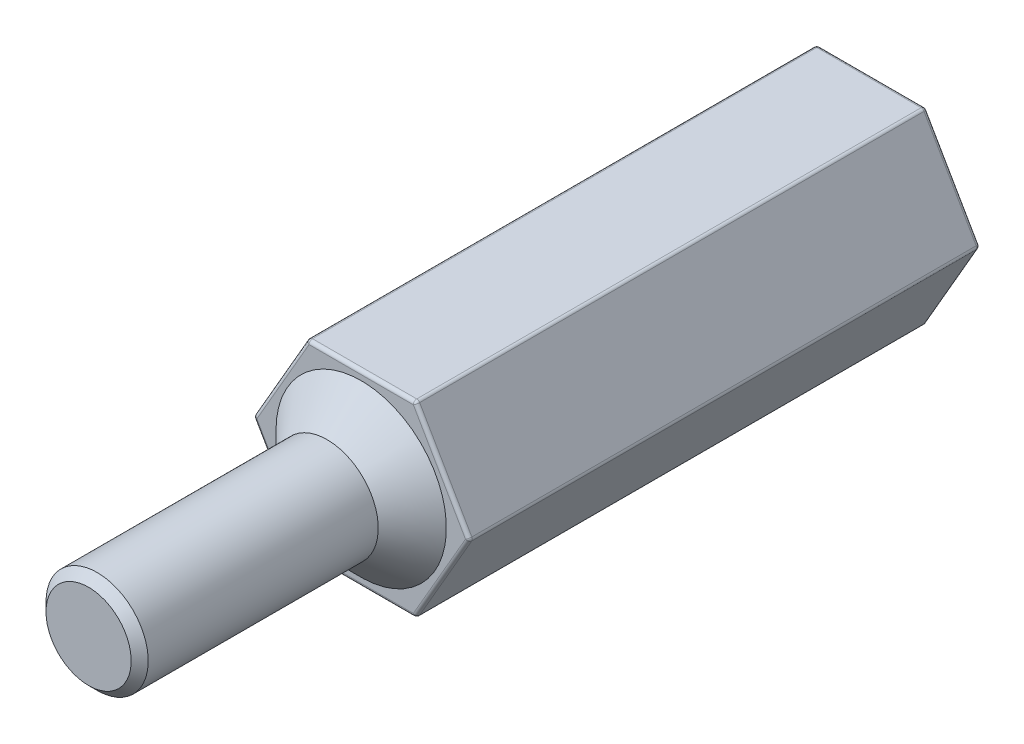
ISO-10303-21;
HEADER;
FILE_DESCRIPTION(('STEP AP214'),'2;1');
FILE_NAME('part.step','',(''),(''),'','','');
FILE_SCHEMA(('AUTOMOTIVE_DESIGN { 1 0 10303 214 1 1 1 1 }'));
ENDSEC;
DATA;
#1=APPLICATION_CONTEXT('core data for automotive mechanical design processes');
#2=APPLICATION_PROTOCOL_DEFINITION('international standard','automotive_design',2000,#1);
#3=PRODUCT_CONTEXT('',#1,'mechanical');
#4=PRODUCT('Part','Part','',(#3));
#5=PRODUCT_RELATED_PRODUCT_CATEGORY('part','',(#4));
#6=PRODUCT_DEFINITION_FORMATION('','',#4);
#7=PRODUCT_DEFINITION_CONTEXT('part definition',#1,'design');
#8=PRODUCT_DEFINITION('design','',#6,#7);
#9=PRODUCT_DEFINITION_SHAPE('','',#8);
#10=(LENGTH_UNIT() NAMED_UNIT(*) SI_UNIT(.MILLI.,.METRE.));
#11=(NAMED_UNIT(*) PLANE_ANGLE_UNIT() SI_UNIT($,.RADIAN.));
#12=(NAMED_UNIT(*) SI_UNIT($,.STERADIAN.) SOLID_ANGLE_UNIT());
#13=UNCERTAINTY_MEASURE_WITH_UNIT(LENGTH_MEASURE(1.E-05),#10,'distance_accuracy_value','');
#14=(GEOMETRIC_REPRESENTATION_CONTEXT(3) GLOBAL_UNCERTAINTY_ASSIGNED_CONTEXT((#13)) GLOBAL_UNIT_ASSIGNED_CONTEXT((#10,
#11,#12)) REPRESENTATION_CONTEXT('',''));
#15=CARTESIAN_POINT('',(0.,0.,0.));
#16=DIRECTION('',(0.,0.,1.));
#17=DIRECTION('',(1.,0.,0.));
#18=AXIS2_PLACEMENT_3D('',#15,#16,#17);
#19=CARTESIAN_POINT('',(0.,0.,8.));
#20=DIRECTION('',(0.,0.,1.));
#21=DIRECTION('',(1.,0.,0.));
#22=AXIS2_PLACEMENT_3D('',#19,#20,#21);
#23=PLANE('',#22);
#24=CARTESIAN_POINT('',(0.,0.,7.99999999998136));
#25=DIRECTION('',(0.,0.,-1.));
#26=DIRECTION('',(-1.,0.,0.));
#27=AXIS2_PLACEMENT_3D('',#24,#25,#26);
#28=CIRCLE('',#27,1.25000000002728);
#29=CARTESIAN_POINT('',(-1.25000000002728,0.,7.99999999998136));
#30=VERTEX_POINT('',#29);
#31=EDGE_CURVE('E20',#30,#30,#28,.T.);
#32=ORIENTED_EDGE('',*,*,#31,.F.);
#33=EDGE_LOOP('',(#32));
#34=FACE_BOUND('',#33,.T.);
#35=ADVANCED_FACE('F17',(#34),#23,.T.);
#36=CARTESIAN_POINT('',(0.,0.,7.74999999998727));
#37=DIRECTION('',(0.,0.,-1.));
#38=DIRECTION('',(-1.,0.,0.));
#39=AXIS2_PLACEMENT_3D('',#36,#37,#38);
#40=CONICAL_SURFACE('',#39,1.50000000002137,0.785398163397448);
#41=CARTESIAN_POINT('',(0.,0.,7.74999999999999));
#42=DIRECTION('',(0.,0.,-1.));
#43=DIRECTION('',(-1.,0.,0.));
#44=AXIS2_PLACEMENT_3D('',#41,#42,#43);
#45=CIRCLE('',#44,1.5);
#46=CARTESIAN_POINT('',(-1.5,0.,7.74999999999999));
#47=VERTEX_POINT('',#46);
#48=EDGE_CURVE('E205',#47,#47,#45,.T.);
#49=ORIENTED_EDGE('',*,*,#48,.F.);
#50=EDGE_LOOP('',(#49));
#51=FACE_BOUND('',#50,.T.);
#52=ORIENTED_EDGE('',*,*,#31,.T.);
#53=EDGE_LOOP('',(#52));
#54=FACE_BOUND('',#53,.T.);
#55=ADVANCED_FACE('F921',(#51,#54),#40,.T.);
#56=CARTESIAN_POINT('',(0.,0.,8.));
#57=DIRECTION('',(0.,0.,-1.));
#58=DIRECTION('',(-1.,0.,0.));
#59=AXIS2_PLACEMENT_3D('',#56,#57,#58);
#60=CYLINDRICAL_SURFACE('',#59,1.5);
#61=CARTESIAN_POINT('',(0.,0.,0.99999999991951));
#62=DIRECTION('',(0.,0.,-1.));
#63=DIRECTION('',(-1.,0.,0.));
#64=AXIS2_PLACEMENT_3D('',#61,#62,#63);
#65=CIRCLE('',#64,1.50000000002137);
#66=CARTESIAN_POINT('',(-1.50000000002137,0.,0.99999999991951));
#67=VERTEX_POINT('',#66);
#68=EDGE_CURVE('E201',#67,#67,#65,.T.);
#69=ORIENTED_EDGE('',*,*,#68,.F.);
#70=EDGE_LOOP('',(#69));
#71=FACE_BOUND('',#70,.T.);
#72=ORIENTED_EDGE('',*,*,#48,.T.);
#73=EDGE_LOOP('',(#72));
#74=FACE_BOUND('',#73,.T.);
#75=ADVANCED_FACE('F915',(#71,#74),#60,.T.);
#76=CARTESIAN_POINT('',(0.,0.,-5.6843418860808E-11));
#77=DIRECTION('',(0.,0.,-1.));
#78=DIRECTION('',(-1.,0.,0.));
#79=AXIS2_PLACEMENT_3D('',#76,#77,#78);
#80=CONICAL_SURFACE('',#79,2.49999999999773,0.785398163397448);
#81=CARTESIAN_POINT('',(0.,0.,-5.6843418860808E-11));
#82=DIRECTION('',(0.,0.,-1.));
#83=DIRECTION('',(-1.,0.,0.));
#84=AXIS2_PLACEMENT_3D('',#81,#82,#83);
#85=CIRCLE('',#84,2.49999999999773);
#86=CARTESIAN_POINT('',(-2.49999999999773,0.,-5.6843418860808E-11));
#87=VERTEX_POINT('',#86);
#88=EDGE_CURVE('E199',#87,#87,#85,.F.);
#89=ORIENTED_EDGE('',*,*,#88,.T.);
#90=EDGE_LOOP('',(#89));
#91=FACE_BOUND('',#90,.T.);
#92=ORIENTED_EDGE('',*,*,#68,.T.);
#93=EDGE_LOOP('',(#92));
#94=FACE_BOUND('',#93,.T.);
#95=ADVANCED_FACE('F372',(#91,#94),#80,.T.);
#96=CARTESIAN_POINT('',(-1.52997821335251,2.65,-0.1));
#97=DIRECTION('',(1.,0.,0.));
#98=DIRECTION('',(0.,0.,-1.));
#99=AXIS2_PLACEMENT_3D('',#96,#97,#98);
#100=SPHERICAL_SURFACE('',#99,0.1);
#101=CARTESIAN_POINT('',(-1.52997821335251,2.65,-0.0999999999999994));
#102=DIRECTION('',(1.,0.,0.));
#103=DIRECTION('',(0.,0.,-1.));
#104=AXIS2_PLACEMENT_3D('',#101,#102,#103);
#105=CIRCLE('',#104,0.1);
#106=CARTESIAN_POINT('',(-1.52997821335251,2.75,-0.0999999999999994));
#107=VERTEX_POINT('',#106);
#108=CARTESIAN_POINT('',(-1.52997821335251,2.65,0.));
#109=VERTEX_POINT('',#108);
#110=EDGE_CURVE('E195',#107,#109,#105,.T.);
#111=ORIENTED_EDGE('',*,*,#110,.F.);
#112=CARTESIAN_POINT('',(-1.52997821335251,2.65,-0.0999999999999994));
#113=DIRECTION('',(0.,0.,1.));
#114=DIRECTION('',(1.,0.,0.));
#115=AXIS2_PLACEMENT_3D('',#112,#113,#114);
#116=CIRCLE('',#115,0.1);
#117=CARTESIAN_POINT('',(-1.61658075373095,2.7,-0.0999999999999994));
#118=VERTEX_POINT('',#117);
#119=EDGE_CURVE('E309',#118,#107,#116,.F.);
#120=ORIENTED_EDGE('',*,*,#119,.F.);
#121=CARTESIAN_POINT('',(-1.52997821335251,2.65,-0.0999999999999994));
#122=DIRECTION('',(0.5,0.866025403784439,0.));
#123=DIRECTION('',(-0.866025403784439,0.5,0.));
#124=AXIS2_PLACEMENT_3D('',#121,#122,#123);
#125=CIRCLE('',#124,0.0999999999999999);
#126=EDGE_CURVE('E193',#109,#118,#125,.F.);
#127=ORIENTED_EDGE('',*,*,#126,.F.);
#128=EDGE_LOOP('',(#111,#120,#127));
#129=FACE_BOUND('',#128,.T.);
#130=ADVANCED_FACE('F368',(#129),#100,.T.);
#131=CARTESIAN_POINT('',(1.52997821335251,2.65,-0.1));
#132=DIRECTION('',(1.,0.,0.));
#133=DIRECTION('',(0.,0.,-1.));
#134=AXIS2_PLACEMENT_3D('',#131,#132,#133);
#135=SPHERICAL_SURFACE('',#134,0.1);
#136=CARTESIAN_POINT('',(1.52997821335251,2.65,-0.0999999999999994));
#137=DIRECTION('',(0.5,-0.866025403784439,0.));
#138=DIRECTION('',(0.866025403784439,0.5,0.));
#139=AXIS2_PLACEMENT_3D('',#136,#137,#138);
#140=CIRCLE('',#139,0.1);
#141=CARTESIAN_POINT('',(1.61658075373095,2.7,-0.0999999999999994));
#142=VERTEX_POINT('',#141);
#143=CARTESIAN_POINT('',(1.52997821335251,2.65,0.));
#144=VERTEX_POINT('',#143);
#145=EDGE_CURVE('E186',#142,#144,#140,.T.);
#146=ORIENTED_EDGE('',*,*,#145,.F.);
#147=CARTESIAN_POINT('',(1.52997821335251,2.65,-0.0999999999999994));
#148=DIRECTION('',(0.,0.,1.));
#149=DIRECTION('',(1.,0.,0.));
#150=AXIS2_PLACEMENT_3D('',#147,#148,#149);
#151=CIRCLE('',#150,0.1);
#152=CARTESIAN_POINT('',(1.52997821335251,2.75,-0.0999999999999994));
#153=VERTEX_POINT('',#152);
#154=EDGE_CURVE('E185',#153,#142,#151,.F.);
#155=ORIENTED_EDGE('',*,*,#154,.F.);
#156=CARTESIAN_POINT('',(1.52997821335251,2.65,-0.0999999999999994));
#157=DIRECTION('',(1.,0.,0.));
#158=DIRECTION('',(0.,0.,-1.));
#159=AXIS2_PLACEMENT_3D('',#156,#157,#158);
#160=CIRCLE('',#159,0.1);
#161=EDGE_CURVE('E96',#144,#153,#160,.F.);
#162=ORIENTED_EDGE('',*,*,#161,.F.);
#163=EDGE_LOOP('',(#146,#155,#162));
#164=FACE_BOUND('',#163,.T.);
#165=ADVANCED_FACE('F365',(#164),#135,.T.);
#166=CARTESIAN_POINT('',(3.05995642670502,0.,-0.1));
#167=DIRECTION('',(1.,0.,0.));
#168=DIRECTION('',(0.,0.,-1.));
#169=AXIS2_PLACEMENT_3D('',#166,#167,#168);
#170=SPHERICAL_SURFACE('',#169,0.1);
#171=CARTESIAN_POINT('',(3.05995642670502,0.,-0.0999999999999994));
#172=DIRECTION('',(0.,0.,1.));
#173=DIRECTION('',(1.,0.,0.));
#174=AXIS2_PLACEMENT_3D('',#171,#172,#173);
#175=CIRCLE('',#174,0.0999999999999998);
#176=CARTESIAN_POINT('',(3.15995642670502,0.,-0.0999999999999995));
#177=VERTEX_POINT('',#176);
#178=CARTESIAN_POINT('',(3.14655896708346,-0.0500000000000013,-0.0999999999999994));
#179=VERTEX_POINT('',#178);
#180=EDGE_CURVE('E285',#177,#179,#175,.F.);
#181=ORIENTED_EDGE('',*,*,#180,.F.);
#182=CARTESIAN_POINT('',(3.05995642670502,0.,-0.0999999999999994));
#183=DIRECTION('',(0.,0.,1.));
#184=DIRECTION('',(1.,0.,0.));
#185=AXIS2_PLACEMENT_3D('',#182,#183,#184);
#186=CIRCLE('',#185,0.0999999999999998);
#187=CARTESIAN_POINT('',(3.14655896708346,0.0499999999999986,-0.0999999999999994));
#188=VERTEX_POINT('',#187);
#189=EDGE_CURVE('E192',#188,#177,#186,.F.);
#190=ORIENTED_EDGE('',*,*,#189,.F.);
#191=CARTESIAN_POINT('',(3.05995642670502,0.,-0.0999999999999994));
#192=DIRECTION('',(0.5,-0.866025403784439,0.));
#193=DIRECTION('',(0.866025403784439,0.5,0.));
#194=AXIS2_PLACEMENT_3D('',#191,#192,#193);
#195=CIRCLE('',#194,0.1);
#196=CARTESIAN_POINT('',(3.05995642670502,0.,0.));
#197=VERTEX_POINT('',#196);
#198=EDGE_CURVE('E190',#197,#188,#195,.F.);
#199=ORIENTED_EDGE('',*,*,#198,.F.);
#200=CARTESIAN_POINT('',(3.05995642670502,0.,-0.0999999999999994));
#201=DIRECTION('',(-0.5,-0.866025403784439,0.));
#202=DIRECTION('',(0.866025403784439,-0.5,0.));
#203=AXIS2_PLACEMENT_3D('',#200,#201,#202);
#204=CIRCLE('',#203,0.0999999999999999);
#205=EDGE_CURVE('E179',#179,#197,#204,.T.);
#206=ORIENTED_EDGE('',*,*,#205,.F.);
#207=EDGE_LOOP('',(#181,#190,#199,#206));
#208=FACE_BOUND('',#207,.T.);
#209=ADVANCED_FACE('F353',(#208),#170,.T.);
#210=CARTESIAN_POINT('',(1.52997821335251,-2.65,-0.1));
#211=DIRECTION('',(1.,0.,0.));
#212=DIRECTION('',(0.,0.,-1.));
#213=AXIS2_PLACEMENT_3D('',#210,#211,#212);
#214=SPHERICAL_SURFACE('',#213,0.1);
#215=CARTESIAN_POINT('',(1.52997821335251,-2.65,-0.0999999999999994));
#216=DIRECTION('',(-1.,0.,0.));
#217=DIRECTION('',(0.,-1.,0.));
#218=AXIS2_PLACEMENT_3D('',#215,#216,#217);
#219=CIRCLE('',#218,0.0999999999999998);
#220=CARTESIAN_POINT('',(1.52997821335251,-2.75,-0.0999999999999994));
#221=VERTEX_POINT('',#220);
#222=CARTESIAN_POINT('',(1.52997821335251,-2.65,0.));
#223=VERTEX_POINT('',#222);
#224=EDGE_CURVE('E284',#221,#223,#219,.T.);
#225=ORIENTED_EDGE('',*,*,#224,.F.);
#226=CARTESIAN_POINT('',(1.52997821335251,-2.65,-0.0999999999999994));
#227=DIRECTION('',(0.,0.,1.));
#228=DIRECTION('',(1.,0.,0.));
#229=AXIS2_PLACEMENT_3D('',#226,#227,#228);
#230=CIRCLE('',#229,0.1);
#231=CARTESIAN_POINT('',(1.61658075373095,-2.7,-0.0999999999999994));
#232=VERTEX_POINT('',#231);
#233=EDGE_CURVE('E178',#232,#221,#230,.F.);
#234=ORIENTED_EDGE('',*,*,#233,.F.);
#235=CARTESIAN_POINT('',(1.52997821335251,-2.65,-0.0999999999999994));
#236=DIRECTION('',(-0.5,-0.866025403784439,0.));
#237=DIRECTION('',(0.866025403784439,-0.5,0.));
#238=AXIS2_PLACEMENT_3D('',#235,#236,#237);
#239=CIRCLE('',#238,0.0999999999999999);
#240=EDGE_CURVE('E183',#223,#232,#239,.F.);
#241=ORIENTED_EDGE('',*,*,#240,.F.);
#242=EDGE_LOOP('',(#225,#234,#241));
#243=FACE_BOUND('',#242,.T.);
#244=ADVANCED_FACE('F348',(#243),#214,.T.);
#245=CARTESIAN_POINT('',(-3.17542648054294,0.,0.));
#246=DIRECTION('',(0.,0.,-1.));
#247=DIRECTION('',(-1.,0.,0.));
#248=AXIS2_PLACEMENT_3D('',#245,#246,#247);
#249=PLANE('',#248);
#250=ORIENTED_EDGE('',*,*,#88,.F.);
#251=EDGE_LOOP('',(#250));
#252=FACE_BOUND('',#251,.T.);
#253=DIRECTION('',(1.,0.,0.));
#254=VECTOR('',#253,1.);
#255=CARTESIAN_POINT('',(-1.58771324027147,2.65,0.));
#256=LINE('',#255,#254);
#257=EDGE_CURVE('E323',#109,#144,#256,.T.);
#258=ORIENTED_EDGE('',*,*,#257,.F.);
#259=DIRECTION('',(0.5,0.866025403784439,0.));
#260=VECTOR('',#259,1.);
#261=CARTESIAN_POINT('',(-3.0888239401645,-0.0499999999999996,0.));
#262=LINE('',#261,#260);
#263=CARTESIAN_POINT('',(-3.05995642670502,0.,0.));
#264=VERTEX_POINT('',#263);
#265=EDGE_CURVE('E196',#264,#109,#262,.T.);
#266=ORIENTED_EDGE('',*,*,#265,.F.);
#267=DIRECTION('',(-0.5,0.866025403784439,0.));
#268=VECTOR('',#267,1.);
#269=CARTESIAN_POINT('',(-1.50111069989303,-2.7,0.));
#270=LINE('',#269,#268);
#271=CARTESIAN_POINT('',(-1.52997821335251,-2.65,0.));
#272=VERTEX_POINT('',#271);
#273=EDGE_CURVE('E174',#272,#264,#270,.T.);
#274=ORIENTED_EDGE('',*,*,#273,.F.);
#275=DIRECTION('',(-1.,0.,0.));
#276=VECTOR('',#275,1.);
#277=CARTESIAN_POINT('',(1.58771324027147,-2.65,0.));
#278=LINE('',#277,#276);
#279=EDGE_CURVE('E278',#223,#272,#278,.T.);
#280=ORIENTED_EDGE('',*,*,#279,.F.);
#281=DIRECTION('',(-0.5,-0.866025403784439,0.));
#282=VECTOR('',#281,1.);
#283=CARTESIAN_POINT('',(3.0888239401645,0.0499999999999992,0.));
#284=LINE('',#283,#282);
#285=EDGE_CURVE('E182',#197,#223,#284,.T.);
#286=ORIENTED_EDGE('',*,*,#285,.F.);
#287=DIRECTION('',(0.5,-0.866025403784439,0.));
#288=VECTOR('',#287,1.);
#289=CARTESIAN_POINT('',(1.50111069989303,2.7,0.));
#290=LINE('',#289,#288);
#291=EDGE_CURVE('E189',#144,#197,#290,.T.);
#292=ORIENTED_EDGE('',*,*,#291,.F.);
#293=EDGE_LOOP('',(#258,#266,#274,#280,#286,#292));
#294=FACE_BOUND('',#293,.T.);
#295=ADVANCED_FACE('F344',(#252,#294),#249,.F.);
#296=CARTESIAN_POINT('',(-1.52997821335251,-2.65,-0.1));
#297=DIRECTION('',(1.,0.,0.));
#298=DIRECTION('',(0.,0.,-1.));
#299=AXIS2_PLACEMENT_3D('',#296,#297,#298);
#300=SPHERICAL_SURFACE('',#299,0.1);
#301=CARTESIAN_POINT('',(-1.52997821335251,-2.65,-0.0999999999999994));
#302=DIRECTION('',(-1.,0.,0.));
#303=DIRECTION('',(0.,-1.,0.));
#304=AXIS2_PLACEMENT_3D('',#301,#302,#303);
#305=CIRCLE('',#304,0.0999999999999998);
#306=CARTESIAN_POINT('',(-1.52997821335251,-2.75,-0.0999999999999994));
#307=VERTEX_POINT('',#306);
#308=EDGE_CURVE('E281',#272,#307,#305,.F.);
#309=ORIENTED_EDGE('',*,*,#308,.F.);
#310=CARTESIAN_POINT('',(-1.52997821335251,-2.65,-0.0999999999999994));
#311=DIRECTION('',(-0.5,0.866025403784439,0.));
#312=DIRECTION('',(-0.866025403784439,-0.5,0.));
#313=AXIS2_PLACEMENT_3D('',#310,#311,#312);
#314=CIRCLE('',#313,0.1);
#315=CARTESIAN_POINT('',(-1.61658075373095,-2.7,-0.0999999999999994));
#316=VERTEX_POINT('',#315);
#317=EDGE_CURVE('E175',#316,#272,#314,.T.);
#318=ORIENTED_EDGE('',*,*,#317,.F.);
#319=CARTESIAN_POINT('',(-1.52997821335251,-2.65,-0.0999999999999994));
#320=DIRECTION('',(0.,0.,1.));
#321=DIRECTION('',(1.,0.,0.));
#322=AXIS2_PLACEMENT_3D('',#319,#320,#321);
#323=CIRCLE('',#322,0.1);
#324=EDGE_CURVE('E173',#307,#316,#323,.F.);
#325=ORIENTED_EDGE('',*,*,#324,.F.);
#326=EDGE_LOOP('',(#309,#318,#325));
#327=FACE_BOUND('',#326,.T.);
#328=ADVANCED_FACE('F339',(#327),#300,.T.);
#329=CARTESIAN_POINT('',(-3.05995642670502,0.,-0.1));
#330=DIRECTION('',(1.,0.,0.));
#331=DIRECTION('',(0.,0.,-1.));
#332=AXIS2_PLACEMENT_3D('',#329,#330,#331);
#333=SPHERICAL_SURFACE('',#332,0.1);
#334=CARTESIAN_POINT('',(-3.05995642670502,0.,-0.0999999999999994));
#335=DIRECTION('',(-0.5,0.866025403784439,0.));
#336=DIRECTION('',(-0.866025403784439,-0.5,0.));
#337=AXIS2_PLACEMENT_3D('',#334,#335,#336);
#338=CIRCLE('',#337,0.1);
#339=CARTESIAN_POINT('',(-3.14655896708346,-0.049999999999999,-0.0999999999999994));
#340=VERTEX_POINT('',#339);
#341=EDGE_CURVE('E171',#264,#340,#338,.F.);
#342=ORIENTED_EDGE('',*,*,#341,.F.);
#343=CARTESIAN_POINT('',(-3.05995642670502,0.,-0.0999999999999994));
#344=DIRECTION('',(0.5,0.866025403784439,0.));
#345=DIRECTION('',(-0.866025403784439,0.5,0.));
#346=AXIS2_PLACEMENT_3D('',#343,#344,#345);
#347=CIRCLE('',#346,0.0999999999999999);
#348=CARTESIAN_POINT('',(-3.14655896708346,0.0500000000000008,-0.0999999999999994));
#349=VERTEX_POINT('',#348);
#350=EDGE_CURVE('E197',#349,#264,#347,.T.);
#351=ORIENTED_EDGE('',*,*,#350,.F.);
#352=CARTESIAN_POINT('',(-3.05995642670502,0.,-0.0999999999999994));
#353=DIRECTION('',(0.,0.,1.));
#354=DIRECTION('',(1.,0.,0.));
#355=AXIS2_PLACEMENT_3D('',#352,#353,#354);
#356=CIRCLE('',#355,0.0999999999999998);
#357=CARTESIAN_POINT('',(-3.15995642670502,0.,-0.0999999999999994));
#358=VERTEX_POINT('',#357);
#359=EDGE_CURVE('E89',#358,#349,#356,.F.);
#360=ORIENTED_EDGE('',*,*,#359,.F.);
#361=CARTESIAN_POINT('',(-3.05995642670502,0.,-0.0999999999999994));
#362=DIRECTION('',(0.,0.,1.));
#363=DIRECTION('',(1.,0.,0.));
#364=AXIS2_PLACEMENT_3D('',#361,#362,#363);
#365=CIRCLE('',#364,0.0999999999999998);
#366=EDGE_CURVE('E35',#340,#358,#365,.F.);
#367=ORIENTED_EDGE('',*,*,#366,.F.);
#368=EDGE_LOOP('',(#342,#351,#360,#367));
#369=FACE_BOUND('',#368,.T.);
#370=ADVANCED_FACE('F334',(#369),#333,.T.);
#371=CARTESIAN_POINT('',(-3.0888239401645,-0.0499999999999996,-0.0999999999999994));
#372=DIRECTION('',(0.5,0.866025403784439,0.));
#373=DIRECTION('',(-0.866025403784439,0.5,0.));
#374=AXIS2_PLACEMENT_3D('',#371,#372,#373);
#375=CYLINDRICAL_SURFACE('',#374,0.0999999999999999);
#376=ORIENTED_EDGE('',*,*,#126,.T.);
#377=DIRECTION('',(0.5,0.866025403784439,0.));
#378=VECTOR('',#377,1.);
#379=CARTESIAN_POINT('',(-3.17542648054294,0.,-0.0999999999999994));
#380=LINE('',#379,#378);
#381=EDGE_CURVE('E162',#118,#349,#380,.F.);
#382=ORIENTED_EDGE('',*,*,#381,.T.);
#383=ORIENTED_EDGE('',*,*,#350,.T.);
#384=ORIENTED_EDGE('',*,*,#265,.T.);
#385=EDGE_LOOP('',(#376,#382,#383,#384));
#386=FACE_BOUND('',#385,.T.);
#387=ADVANCED_FACE('F338',(#386),#375,.T.);
#388=CARTESIAN_POINT('',(-1.58771324027147,2.65,-0.0999999999999994));
#389=DIRECTION('',(1.,0.,0.));
#390=DIRECTION('',(0.,0.,-1.));
#391=AXIS2_PLACEMENT_3D('',#388,#389,#390);
#392=CYLINDRICAL_SURFACE('',#391,0.1);
#393=ORIENTED_EDGE('',*,*,#161,.T.);
#394=DIRECTION('',(1.,0.,0.));
#395=VECTOR('',#394,1.);
#396=CARTESIAN_POINT('',(-1.58771324027147,2.75,-0.0999999999999994));
#397=LINE('',#396,#395);
#398=EDGE_CURVE('E315',#153,#107,#397,.F.);
#399=ORIENTED_EDGE('',*,*,#398,.T.);
#400=ORIENTED_EDGE('',*,*,#110,.T.);
#401=ORIENTED_EDGE('',*,*,#257,.T.);
#402=EDGE_LOOP('',(#393,#399,#400,#401));
#403=FACE_BOUND('',#402,.T.);
#404=ADVANCED_FACE('F378',(#403),#392,.T.);
#405=CARTESIAN_POINT('',(-1.52997821335251,2.65,-15.));
#406=DIRECTION('',(0.,0.,1.));
#407=DIRECTION('',(1.,0.,0.));
#408=AXIS2_PLACEMENT_3D('',#405,#406,#407);
#409=CYLINDRICAL_SURFACE('',#408,0.1);
#410=CARTESIAN_POINT('',(-1.52997821335251,2.65,-14.9));
#411=DIRECTION('',(0.,0.,1.));
#412=DIRECTION('',(1.,0.,0.));
#413=AXIS2_PLACEMENT_3D('',#410,#411,#412);
#414=CIRCLE('',#413,0.1);
#415=CARTESIAN_POINT('',(-1.61658075373095,2.7,-14.9));
#416=VERTEX_POINT('',#415);
#417=CARTESIAN_POINT('',(-1.52997821335251,2.75,-14.9));
#418=VERTEX_POINT('',#417);
#419=EDGE_CURVE('E258',#416,#418,#414,.F.);
#420=ORIENTED_EDGE('',*,*,#419,.F.);
#421=DIRECTION('',(0.,0.,1.));
#422=VECTOR('',#421,1.);
#423=CARTESIAN_POINT('',(-1.61658075373095,2.7,-15.));
#424=LINE('',#423,#422);
#425=EDGE_CURVE('E255',#416,#118,#424,.T.);
#426=ORIENTED_EDGE('',*,*,#425,.T.);
#427=ORIENTED_EDGE('',*,*,#119,.T.);
#428=DIRECTION('',(0.,0.,-1.));
#429=VECTOR('',#428,1.);
#430=CARTESIAN_POINT('',(-1.52997821335251,2.75,-15.));
#431=LINE('',#430,#429);
#432=EDGE_CURVE('E317',#107,#418,#431,.T.);
#433=ORIENTED_EDGE('',*,*,#432,.T.);
#434=EDGE_LOOP('',(#420,#426,#427,#433));
#435=FACE_BOUND('',#434,.T.);
#436=ADVANCED_FACE('F461',(#435),#409,.T.);
#437=CARTESIAN_POINT('',(1.50111069989303,2.7,-0.0999999999999994));
#438=DIRECTION('',(0.5,-0.866025403784439,0.));
#439=DIRECTION('',(0.866025403784439,0.5,0.));
#440=AXIS2_PLACEMENT_3D('',#437,#438,#439);
#441=CYLINDRICAL_SURFACE('',#440,0.1);
#442=ORIENTED_EDGE('',*,*,#145,.T.);
#443=ORIENTED_EDGE('',*,*,#291,.T.);
#444=ORIENTED_EDGE('',*,*,#198,.T.);
#445=DIRECTION('',(0.5,-0.866025403784439,0.));
#446=VECTOR('',#445,1.);
#447=CARTESIAN_POINT('',(1.58771324027147,2.75,-0.0999999999999994));
#448=LINE('',#447,#446);
#449=EDGE_CURVE('E303',#188,#142,#448,.F.);
#450=ORIENTED_EDGE('',*,*,#449,.T.);
#451=EDGE_LOOP('',(#442,#443,#444,#450));
#452=FACE_BOUND('',#451,.T.);
#453=ADVANCED_FACE('F387',(#452),#441,.T.);
#454=CARTESIAN_POINT('',(1.52997821335251,2.65,-15.));
#455=DIRECTION('',(0.,0.,1.));
#456=DIRECTION('',(1.,0.,0.));
#457=AXIS2_PLACEMENT_3D('',#454,#455,#456);
#458=CYLINDRICAL_SURFACE('',#457,0.1);
#459=CARTESIAN_POINT('',(1.52997821335251,2.65,-14.9));
#460=DIRECTION('',(0.,0.,1.));
#461=DIRECTION('',(1.,0.,0.));
#462=AXIS2_PLACEMENT_3D('',#459,#460,#461);
#463=CIRCLE('',#462,0.1);
#464=CARTESIAN_POINT('',(1.52997821335251,2.75,-14.9));
#465=VERTEX_POINT('',#464);
#466=CARTESIAN_POINT('',(1.61658075373095,2.7,-14.9));
#467=VERTEX_POINT('',#466);
#468=EDGE_CURVE('E403',#465,#467,#463,.F.);
#469=ORIENTED_EDGE('',*,*,#468,.F.);
#470=DIRECTION('',(0.,0.,-1.));
#471=VECTOR('',#470,1.);
#472=CARTESIAN_POINT('',(1.52997821335251,2.75,-15.));
#473=LINE('',#472,#471);
#474=EDGE_CURVE('E318',#465,#153,#473,.F.);
#475=ORIENTED_EDGE('',*,*,#474,.T.);
#476=ORIENTED_EDGE('',*,*,#154,.T.);
#477=DIRECTION('',(0.,0.,1.));
#478=VECTOR('',#477,1.);
#479=CARTESIAN_POINT('',(1.61658075373095,2.7,-15.));
#480=LINE('',#479,#478);
#481=EDGE_CURVE('E306',#142,#467,#480,.F.);
#482=ORIENTED_EDGE('',*,*,#481,.T.);
#483=EDGE_LOOP('',(#469,#475,#476,#482));
#484=FACE_BOUND('',#483,.T.);
#485=ADVANCED_FACE('F402',(#484),#458,.T.);
#486=CARTESIAN_POINT('',(3.0888239401645,0.0499999999999991,-0.0999999999999994));
#487=DIRECTION('',(-0.5,-0.866025403784439,0.));
#488=DIRECTION('',(0.866025403784439,-0.5,0.));
#489=AXIS2_PLACEMENT_3D('',#486,#487,#488);
#490=CYLINDRICAL_SURFACE('',#489,0.0999999999999999);
#491=ORIENTED_EDGE('',*,*,#205,.T.);
#492=ORIENTED_EDGE('',*,*,#285,.T.);
#493=ORIENTED_EDGE('',*,*,#240,.T.);
#494=DIRECTION('',(-0.5,-0.866025403784439,0.));
#495=VECTOR('',#494,1.);
#496=CARTESIAN_POINT('',(3.17542648054294,0.,-0.0999999999999994));
#497=LINE('',#496,#495);
#498=EDGE_CURVE('E292',#232,#179,#497,.F.);
#499=ORIENTED_EDGE('',*,*,#498,.T.);
#500=EDGE_LOOP('',(#491,#492,#493,#499));
#501=FACE_BOUND('',#500,.T.);
#502=ADVANCED_FACE('F452',(#501),#490,.T.);
#503=CARTESIAN_POINT('',(3.05995642670502,0.,-15.));
#504=DIRECTION('',(0.,0.,1.));
#505=DIRECTION('',(1.,0.,0.));
#506=AXIS2_PLACEMENT_3D('',#503,#504,#505);
#507=CYLINDRICAL_SURFACE('',#506,0.0999999999999998);
#508=ORIENTED_EDGE('',*,*,#180,.T.);
#509=DIRECTION('',(0.,0.,1.));
#510=VECTOR('',#509,1.);
#511=CARTESIAN_POINT('',(3.14655896708346,-0.0500000000000012,-15.));
#512=LINE('',#511,#510);
#513=CARTESIAN_POINT('',(3.14655896708346,-0.0500000000000009,-14.9));
#514=VERTEX_POINT('',#513);
#515=EDGE_CURVE('E295',#179,#514,#512,.F.);
#516=ORIENTED_EDGE('',*,*,#515,.T.);
#517=CARTESIAN_POINT('',(3.05995642670502,0.,-14.9));
#518=DIRECTION('',(0.,0.,-1.));
#519=DIRECTION('',(1.,0.,0.));
#520=AXIS2_PLACEMENT_3D('',#517,#518,#519);
#521=CIRCLE('',#520,0.1);
#522=CARTESIAN_POINT('',(3.15995642670502,0.,-14.9));
#523=VERTEX_POINT('',#522);
#524=EDGE_CURVE('E296',#523,#514,#521,.T.);
#525=ORIENTED_EDGE('',*,*,#524,.F.);
#526=CARTESIAN_POINT('',(3.05995642670502,0.,-14.9));
#527=DIRECTION('',(0.,0.,1.));
#528=DIRECTION('',(1.,0.,0.));
#529=AXIS2_PLACEMENT_3D('',#526,#527,#528);
#530=CIRCLE('',#529,0.1);
#531=CARTESIAN_POINT('',(3.14655896708346,0.0499999999999983,-14.9));
#532=VERTEX_POINT('',#531);
#533=EDGE_CURVE('E414',#532,#523,#530,.F.);
#534=ORIENTED_EDGE('',*,*,#533,.F.);
#535=DIRECTION('',(0.,0.,1.));
#536=VECTOR('',#535,1.);
#537=CARTESIAN_POINT('',(3.14655896708346,0.0499999999999993,-15.));
#538=LINE('',#537,#536);
#539=EDGE_CURVE('E307',#532,#188,#538,.T.);
#540=ORIENTED_EDGE('',*,*,#539,.T.);
#541=ORIENTED_EDGE('',*,*,#189,.T.);
#542=EDGE_LOOP('',(#508,#516,#525,#534,#540,#541));
#543=FACE_BOUND('',#542,.T.);
#544=ADVANCED_FACE('F448',(#543),#507,.T.);
#545=CARTESIAN_POINT('',(1.58771324027147,-2.65,-0.0999999999999994));
#546=DIRECTION('',(-1.,0.,0.));
#547=DIRECTION('',(0.,-1.,0.));
#548=AXIS2_PLACEMENT_3D('',#545,#546,#547);
#549=CYLINDRICAL_SURFACE('',#548,0.0999999999999998);
#550=ORIENTED_EDGE('',*,*,#224,.T.);
#551=ORIENTED_EDGE('',*,*,#279,.T.);
#552=ORIENTED_EDGE('',*,*,#308,.T.);
#553=DIRECTION('',(-1.,0.,0.));
#554=VECTOR('',#553,1.);
#555=CARTESIAN_POINT('',(1.58771324027147,-2.75,-0.0999999999999994));
#556=LINE('',#555,#554);
#557=EDGE_CURVE('E269',#307,#221,#556,.F.);
#558=ORIENTED_EDGE('',*,*,#557,.T.);
#559=EDGE_LOOP('',(#550,#551,#552,#558));
#560=FACE_BOUND('',#559,.T.);
#561=ADVANCED_FACE('F444',(#560),#549,.T.);
#562=CARTESIAN_POINT('',(1.52997821335251,-2.65,-15.));
#563=DIRECTION('',(0.,0.,1.));
#564=DIRECTION('',(1.,0.,0.));
#565=AXIS2_PLACEMENT_3D('',#562,#563,#564);
#566=CYLINDRICAL_SURFACE('',#565,0.1);
#567=CARTESIAN_POINT('',(1.52997821335251,-2.65,-14.9));
#568=DIRECTION('',(0.,0.,-1.));
#569=DIRECTION('',(1.,0.,0.));
#570=AXIS2_PLACEMENT_3D('',#567,#568,#569);
#571=CIRCLE('',#570,0.1);
#572=CARTESIAN_POINT('',(1.61658075373095,-2.7,-14.9));
#573=VERTEX_POINT('',#572);
#574=CARTESIAN_POINT('',(1.52997821335251,-2.75,-14.9));
#575=VERTEX_POINT('',#574);
#576=EDGE_CURVE('E273',#573,#575,#571,.T.);
#577=ORIENTED_EDGE('',*,*,#576,.F.);
#578=DIRECTION('',(0.,0.,1.));
#579=VECTOR('',#578,1.);
#580=CARTESIAN_POINT('',(1.61658075373095,-2.7,-15.));
#581=LINE('',#580,#579);
#582=EDGE_CURVE('E557',#573,#232,#581,.T.);
#583=ORIENTED_EDGE('',*,*,#582,.T.);
#584=ORIENTED_EDGE('',*,*,#233,.T.);
#585=DIRECTION('',(0.,0.,1.));
#586=VECTOR('',#585,1.);
#587=CARTESIAN_POINT('',(1.52997821335251,-2.75,-15.));
#588=LINE('',#587,#586);
#589=EDGE_CURVE('E272',#221,#575,#588,.F.);
#590=ORIENTED_EDGE('',*,*,#589,.T.);
#591=EDGE_LOOP('',(#577,#583,#584,#590));
#592=FACE_BOUND('',#591,.T.);
#593=ADVANCED_FACE('F440',(#592),#566,.T.);
#594=CARTESIAN_POINT('',(-1.50111069989303,-2.7,-0.0999999999999994));
#595=DIRECTION('',(-0.5,0.866025403784439,0.));
#596=DIRECTION('',(-0.866025403784439,-0.5,0.));
#597=AXIS2_PLACEMENT_3D('',#594,#595,#596);
#598=CYLINDRICAL_SURFACE('',#597,0.1);
#599=ORIENTED_EDGE('',*,*,#341,.T.);
#600=DIRECTION('',(-0.5,0.866025403784439,0.));
#601=VECTOR('',#600,1.);
#602=CARTESIAN_POINT('',(-1.58771324027147,-2.75,-0.0999999999999994));
#603=LINE('',#602,#601);
#604=EDGE_CURVE('E261',#340,#316,#603,.F.);
#605=ORIENTED_EDGE('',*,*,#604,.T.);
#606=ORIENTED_EDGE('',*,*,#317,.T.);
#607=ORIENTED_EDGE('',*,*,#273,.T.);
#608=EDGE_LOOP('',(#599,#605,#606,#607));
#609=FACE_BOUND('',#608,.T.);
#610=ADVANCED_FACE('F436',(#609),#598,.T.);
#611=CARTESIAN_POINT('',(-1.52997821335251,-2.65,-15.));
#612=DIRECTION('',(0.,0.,1.));
#613=DIRECTION('',(1.,0.,0.));
#614=AXIS2_PLACEMENT_3D('',#611,#612,#613);
#615=CYLINDRICAL_SURFACE('',#614,0.1);
#616=CARTESIAN_POINT('',(-1.52997821335251,-2.65,-14.9));
#617=DIRECTION('',(0.,0.,-1.));
#618=DIRECTION('',(1.,0.,0.));
#619=AXIS2_PLACEMENT_3D('',#616,#617,#618);
#620=CIRCLE('',#619,0.1);
#621=CARTESIAN_POINT('',(-1.52997821335251,-2.75,-14.9));
#622=VERTEX_POINT('',#621);
#623=CARTESIAN_POINT('',(-1.61658075373095,-2.7,-14.9));
#624=VERTEX_POINT('',#623);
#625=EDGE_CURVE('E265',#622,#624,#620,.T.);
#626=ORIENTED_EDGE('',*,*,#625,.F.);
#627=DIRECTION('',(0.,0.,1.));
#628=VECTOR('',#627,1.);
#629=CARTESIAN_POINT('',(-1.52997821335251,-2.75,-15.));
#630=LINE('',#629,#628);
#631=EDGE_CURVE('E613',#622,#307,#630,.T.);
#632=ORIENTED_EDGE('',*,*,#631,.T.);
#633=ORIENTED_EDGE('',*,*,#324,.T.);
#634=DIRECTION('',(0.,0.,1.));
#635=VECTOR('',#634,1.);
#636=CARTESIAN_POINT('',(-1.61658075373095,-2.7,-15.));
#637=LINE('',#636,#635);
#638=EDGE_CURVE('E264',#316,#624,#637,.F.);
#639=ORIENTED_EDGE('',*,*,#638,.T.);
#640=EDGE_LOOP('',(#626,#632,#633,#639));
#641=FACE_BOUND('',#640,.T.);
#642=ADVANCED_FACE('F433',(#641),#615,.T.);
#643=CARTESIAN_POINT('',(-3.05995642670502,0.,-15.));
#644=DIRECTION('',(0.,0.,1.));
#645=DIRECTION('',(1.,0.,0.));
#646=AXIS2_PLACEMENT_3D('',#643,#644,#645);
#647=CYLINDRICAL_SURFACE('',#646,0.0999999999999998);
#648=CARTESIAN_POINT('',(-3.05995642670502,0.,-14.9));
#649=DIRECTION('',(0.,0.,1.));
#650=DIRECTION('',(1.,0.,0.));
#651=AXIS2_PLACEMENT_3D('',#648,#649,#650);
#652=CIRCLE('',#651,0.0999999999999998);
#653=CARTESIAN_POINT('',(-3.15995642670502,0.,-14.9));
#654=VERTEX_POINT('',#653);
#655=CARTESIAN_POINT('',(-3.14655896708346,-0.049999999999999,-14.9));
#656=VERTEX_POINT('',#655);
#657=EDGE_CURVE('E150',#654,#656,#652,.T.);
#658=ORIENTED_EDGE('',*,*,#657,.T.);
#659=DIRECTION('',(0.,0.,1.));
#660=VECTOR('',#659,1.);
#661=CARTESIAN_POINT('',(-3.14655896708346,-0.0499999999999988,-15.));
#662=LINE('',#661,#660);
#663=EDGE_CURVE('E250',#656,#340,#662,.T.);
#664=ORIENTED_EDGE('',*,*,#663,.T.);
#665=ORIENTED_EDGE('',*,*,#366,.T.);
#666=ORIENTED_EDGE('',*,*,#359,.T.);
#667=DIRECTION('',(0.,0.,1.));
#668=VECTOR('',#667,1.);
#669=CARTESIAN_POINT('',(-3.14655896708346,0.0500000000000008,-15.));
#670=LINE('',#669,#668);
#671=CARTESIAN_POINT('',(-3.14655896708346,0.0500000000000009,-14.9));
#672=VERTEX_POINT('',#671);
#673=EDGE_CURVE('E153',#349,#672,#670,.F.);
#674=ORIENTED_EDGE('',*,*,#673,.T.);
#675=CARTESIAN_POINT('',(-3.05995642670502,0.,-14.9));
#676=DIRECTION('',(0.,0.,1.));
#677=DIRECTION('',(1.,0.,0.));
#678=AXIS2_PLACEMENT_3D('',#675,#676,#677);
#679=CIRCLE('',#678,0.0999999999999998);
#680=EDGE_CURVE('E147',#672,#654,#679,.T.);
#681=ORIENTED_EDGE('',*,*,#680,.T.);
#682=EDGE_LOOP('',(#658,#664,#665,#666,#674,#681));
#683=FACE_BOUND('',#682,.T.);
#684=ADVANCED_FACE('F149',(#683),#647,.T.);
#685=CARTESIAN_POINT('',(-3.17542648054294,0.,-15.));
#686=DIRECTION('',(0.866025403784439,-0.5,0.));
#687=DIRECTION('',(0.5,0.866025403784439,0.));
#688=AXIS2_PLACEMENT_3D('',#685,#686,#687);
#689=PLANE('',#688);
#690=DIRECTION('',(-0.5,-0.866025403784439,0.));
#691=VECTOR('',#690,1.);
#692=CARTESIAN_POINT('',(-3.17542648054294,0.,-14.9));
#693=LINE('',#692,#691);
#694=EDGE_CURVE('E239',#672,#416,#693,.F.);
#695=ORIENTED_EDGE('',*,*,#694,.F.);
#696=ORIENTED_EDGE('',*,*,#673,.F.);
#697=ORIENTED_EDGE('',*,*,#381,.F.);
#698=ORIENTED_EDGE('',*,*,#425,.F.);
#699=EDGE_LOOP('',(#695,#696,#697,#698));
#700=FACE_BOUND('',#699,.T.);
#701=ADVANCED_FACE('F425',(#700),#689,.F.);
#702=CARTESIAN_POINT('',(-1.52997821335251,2.65,-14.9));
#703=DIRECTION('',(1.,0.,0.));
#704=DIRECTION('',(0.,0.,-1.));
#705=AXIS2_PLACEMENT_3D('',#702,#703,#704);
#706=SPHERICAL_SURFACE('',#705,0.1);
#707=ORIENTED_EDGE('',*,*,#419,.T.);
#708=CARTESIAN_POINT('',(-1.52997821335251,2.65,-14.9));
#709=DIRECTION('',(-1.,0.,0.));
#710=DIRECTION('',(0.,0.,1.));
#711=AXIS2_PLACEMENT_3D('',#708,#709,#710);
#712=CIRCLE('',#711,0.0999999999999994);
#713=CARTESIAN_POINT('',(-1.52997821335251,2.65,-15.));
#714=VERTEX_POINT('',#713);
#715=EDGE_CURVE('E238',#714,#418,#712,.F.);
#716=ORIENTED_EDGE('',*,*,#715,.F.);
#717=CARTESIAN_POINT('',(-1.52997821335251,2.65,-14.9));
#718=DIRECTION('',(-0.5,-0.866025403784439,0.));
#719=DIRECTION('',(0.866025403784439,-0.5,0.));
#720=AXIS2_PLACEMENT_3D('',#717,#718,#719);
#721=CIRCLE('',#720,0.0999999999999999);
#722=EDGE_CURVE('E237',#416,#714,#721,.T.);
#723=ORIENTED_EDGE('',*,*,#722,.F.);
#724=EDGE_LOOP('',(#707,#716,#723));
#725=FACE_BOUND('',#724,.T.);
#726=ADVANCED_FACE('F421',(#725),#706,.T.);
#727=CARTESIAN_POINT('',(-1.58771324027147,2.75,-15.));
#728=DIRECTION('',(0.,-1.,0.));
#729=DIRECTION('',(0.,0.,-1.));
#730=AXIS2_PLACEMENT_3D('',#727,#728,#729);
#731=PLANE('',#730);
#732=ORIENTED_EDGE('',*,*,#432,.F.);
#733=ORIENTED_EDGE('',*,*,#398,.F.);
#734=ORIENTED_EDGE('',*,*,#474,.F.);
#735=DIRECTION('',(-1.,0.,0.));
#736=VECTOR('',#735,1.);
#737=CARTESIAN_POINT('',(-3.17542648054294,2.75,-14.9));
#738=LINE('',#737,#736);
#739=EDGE_CURVE('E246',#418,#465,#738,.F.);
#740=ORIENTED_EDGE('',*,*,#739,.F.);
#741=EDGE_LOOP('',(#732,#733,#734,#740));
#742=FACE_BOUND('',#741,.T.);
#743=ADVANCED_FACE('F397',(#742),#731,.F.);
#744=CARTESIAN_POINT('',(1.52997821335251,2.65,-14.9));
#745=DIRECTION('',(1.,0.,0.));
#746=DIRECTION('',(0.,0.,-1.));
#747=AXIS2_PLACEMENT_3D('',#744,#745,#746);
#748=SPHERICAL_SURFACE('',#747,0.1);
#749=CARTESIAN_POINT('',(1.52997821335251,2.65,-14.9));
#750=DIRECTION('',(-0.5,0.866025403784439,0.));
#751=DIRECTION('',(-0.866025403784439,-0.5,0.));
#752=AXIS2_PLACEMENT_3D('',#749,#750,#751);
#753=CIRCLE('',#752,0.1);
#754=CARTESIAN_POINT('',(1.52997821335251,2.65,-15.));
#755=VERTEX_POINT('',#754);
#756=EDGE_CURVE('E232',#755,#467,#753,.F.);
#757=ORIENTED_EDGE('',*,*,#756,.F.);
#758=CARTESIAN_POINT('',(1.52997821335251,2.65,-14.9));
#759=DIRECTION('',(-1.,0.,0.));
#760=DIRECTION('',(0.,0.,1.));
#761=AXIS2_PLACEMENT_3D('',#758,#759,#760);
#762=CIRCLE('',#761,0.0999999999999994);
#763=EDGE_CURVE('E236',#465,#755,#762,.T.);
#764=ORIENTED_EDGE('',*,*,#763,.F.);
#765=ORIENTED_EDGE('',*,*,#468,.T.);
#766=EDGE_LOOP('',(#757,#764,#765));
#767=FACE_BOUND('',#766,.T.);
#768=ADVANCED_FACE('F573',(#767),#748,.T.);
#769=CARTESIAN_POINT('',(1.58771324027147,2.75,-15.));
#770=DIRECTION('',(-0.866025403784439,-0.5,0.));
#771=DIRECTION('',(0.5,-0.866025403784439,0.));
#772=AXIS2_PLACEMENT_3D('',#769,#770,#771);
#773=PLANE('',#772);
#774=ORIENTED_EDGE('',*,*,#481,.F.);
#775=ORIENTED_EDGE('',*,*,#449,.F.);
#776=ORIENTED_EDGE('',*,*,#539,.F.);
#777=DIRECTION('',(-0.5,0.866025403784439,0.));
#778=VECTOR('',#777,1.);
#779=CARTESIAN_POINT('',(1.58771324027147,2.75,-14.9));
#780=LINE('',#779,#778);
#781=EDGE_CURVE('E231',#467,#532,#780,.F.);
#782=ORIENTED_EDGE('',*,*,#781,.F.);
#783=EDGE_LOOP('',(#774,#775,#776,#782));
#784=FACE_BOUND('',#783,.T.);
#785=ADVANCED_FACE('F570',(#784),#773,.F.);
#786=CARTESIAN_POINT('',(3.05995642670502,0.,-14.9));
#787=DIRECTION('',(1.,0.,0.));
#788=DIRECTION('',(0.,0.,-1.));
#789=AXIS2_PLACEMENT_3D('',#786,#787,#788);
#790=SPHERICAL_SURFACE('',#789,0.1);
#791=CARTESIAN_POINT('',(3.05995642670502,0.,-14.9));
#792=DIRECTION('',(0.5,0.866025403784439,0.));
#793=DIRECTION('',(-0.866025403784439,0.5,0.));
#794=AXIS2_PLACEMENT_3D('',#791,#792,#793);
#795=CIRCLE('',#794,0.1);
#796=CARTESIAN_POINT('',(3.05995642670502,0.,-15.));
#797=VERTEX_POINT('',#796);
#798=EDGE_CURVE('E225',#797,#514,#795,.F.);
#799=ORIENTED_EDGE('',*,*,#798,.F.);
#800=CARTESIAN_POINT('',(3.05995642670502,0.,-14.9));
#801=DIRECTION('',(-0.5,0.866025403784439,0.));
#802=DIRECTION('',(-0.866025403784439,-0.5,0.));
#803=AXIS2_PLACEMENT_3D('',#800,#801,#802);
#804=CIRCLE('',#803,0.1);
#805=EDGE_CURVE('E235',#532,#797,#804,.T.);
#806=ORIENTED_EDGE('',*,*,#805,.F.);
#807=ORIENTED_EDGE('',*,*,#533,.T.);
#808=ORIENTED_EDGE('',*,*,#524,.T.);
#809=EDGE_LOOP('',(#799,#806,#807,#808));
#810=FACE_BOUND('',#809,.T.);
#811=ADVANCED_FACE('F567',(#810),#790,.T.);
#812=CARTESIAN_POINT('',(3.17542648054294,0.,-15.));
#813=DIRECTION('',(-0.866025403784439,0.5,0.));
#814=DIRECTION('',(-0.5,-0.866025403784439,0.));
#815=AXIS2_PLACEMENT_3D('',#812,#813,#814);
#816=PLANE('',#815);
#817=DIRECTION('',(0.5,0.866025403784439,0.));
#818=VECTOR('',#817,1.);
#819=CARTESIAN_POINT('',(1.58771324027147,-2.75,-14.9));
#820=LINE('',#819,#818);
#821=EDGE_CURVE('E228',#514,#573,#820,.F.);
#822=ORIENTED_EDGE('',*,*,#821,.F.);
#823=ORIENTED_EDGE('',*,*,#515,.F.);
#824=ORIENTED_EDGE('',*,*,#498,.F.);
#825=ORIENTED_EDGE('',*,*,#582,.F.);
#826=EDGE_LOOP('',(#822,#823,#824,#825));
#827=FACE_BOUND('',#826,.T.);
#828=ADVANCED_FACE('F547',(#827),#816,.F.);
#829=CARTESIAN_POINT('',(1.52997821335251,-2.65,-14.9));
#830=DIRECTION('',(1.,0.,0.));
#831=DIRECTION('',(0.,0.,-1.));
#832=AXIS2_PLACEMENT_3D('',#829,#830,#831);
#833=SPHERICAL_SURFACE('',#832,0.1);
#834=CARTESIAN_POINT('',(1.52997821335251,-2.65,-14.9));
#835=DIRECTION('',(1.,0.,0.));
#836=DIRECTION('',(0.,1.,0.));
#837=AXIS2_PLACEMENT_3D('',#834,#835,#836);
#838=CIRCLE('',#837,0.0999999999999998);
#839=CARTESIAN_POINT('',(1.52997821335251,-2.65,-15.));
#840=VERTEX_POINT('',#839);
#841=EDGE_CURVE('E628',#840,#575,#838,.F.);
#842=ORIENTED_EDGE('',*,*,#841,.F.);
#843=CARTESIAN_POINT('',(1.52997821335251,-2.65,-14.9));
#844=DIRECTION('',(0.5,0.866025403784439,0.));
#845=DIRECTION('',(-0.866025403784439,0.5,0.));
#846=AXIS2_PLACEMENT_3D('',#843,#844,#845);
#847=CIRCLE('',#846,0.1);
#848=EDGE_CURVE('E229',#573,#840,#847,.T.);
#849=ORIENTED_EDGE('',*,*,#848,.F.);
#850=ORIENTED_EDGE('',*,*,#576,.T.);
#851=EDGE_LOOP('',(#842,#849,#850));
#852=FACE_BOUND('',#851,.T.);
#853=ADVANCED_FACE('F542',(#852),#833,.T.);
#854=CARTESIAN_POINT('',(1.58771324027147,-2.75,-15.));
#855=DIRECTION('',(0.,1.,0.));
#856=DIRECTION('',(-1.,0.,0.));
#857=AXIS2_PLACEMENT_3D('',#854,#855,#856);
#858=PLANE('',#857);
#859=DIRECTION('',(1.,0.,0.));
#860=VECTOR('',#859,1.);
#861=CARTESIAN_POINT('',(-3.17542648054294,-2.75,-14.9));
#862=LINE('',#861,#860);
#863=EDGE_CURVE('E630',#575,#622,#862,.F.);
#864=ORIENTED_EDGE('',*,*,#863,.F.);
#865=ORIENTED_EDGE('',*,*,#589,.F.);
#866=ORIENTED_EDGE('',*,*,#557,.F.);
#867=ORIENTED_EDGE('',*,*,#631,.F.);
#868=EDGE_LOOP('',(#864,#865,#866,#867));
#869=FACE_BOUND('',#868,.T.);
#870=ADVANCED_FACE('F538',(#869),#858,.F.);
#871=CARTESIAN_POINT('',(-1.52997821335251,-2.65,-14.9));
#872=DIRECTION('',(1.,0.,0.));
#873=DIRECTION('',(0.,0.,-1.));
#874=AXIS2_PLACEMENT_3D('',#871,#872,#873);
#875=SPHERICAL_SURFACE('',#874,0.1);
#876=ORIENTED_EDGE('',*,*,#625,.T.);
#877=CARTESIAN_POINT('',(-1.52997821335251,-2.65,-14.9));
#878=DIRECTION('',(0.5,-0.866025403784439,0.));
#879=DIRECTION('',(0.866025403784439,0.5,0.));
#880=AXIS2_PLACEMENT_3D('',#877,#878,#879);
#881=CIRCLE('',#880,0.0999999999999998);
#882=CARTESIAN_POINT('',(-1.52997821335251,-2.65,-15.));
#883=VERTEX_POINT('',#882);
#884=EDGE_CURVE('E221',#883,#624,#881,.F.);
#885=ORIENTED_EDGE('',*,*,#884,.F.);
#886=CARTESIAN_POINT('',(-1.52997821335251,-2.65,-14.9));
#887=DIRECTION('',(1.,0.,0.));
#888=DIRECTION('',(0.,1.,0.));
#889=AXIS2_PLACEMENT_3D('',#886,#887,#888);
#890=CIRCLE('',#889,0.0999999999999998);
#891=EDGE_CURVE('E224',#622,#883,#890,.T.);
#892=ORIENTED_EDGE('',*,*,#891,.F.);
#893=EDGE_LOOP('',(#876,#885,#892));
#894=FACE_BOUND('',#893,.T.);
#895=ADVANCED_FACE('F535',(#894),#875,.T.);
#896=CARTESIAN_POINT('',(-1.58771324027147,-2.75,-15.));
#897=DIRECTION('',(0.866025403784439,0.5,0.));
#898=DIRECTION('',(-0.5,0.866025403784439,0.));
#899=AXIS2_PLACEMENT_3D('',#896,#897,#898);
#900=PLANE('',#899);
#901=DIRECTION('',(0.5,-0.866025403784439,0.));
#902=VECTOR('',#901,1.);
#903=CARTESIAN_POINT('',(-3.17542648054294,0.,-14.9));
#904=LINE('',#903,#902);
#905=EDGE_CURVE('E220',#624,#656,#904,.F.);
#906=ORIENTED_EDGE('',*,*,#905,.F.);
#907=ORIENTED_EDGE('',*,*,#638,.F.);
#908=ORIENTED_EDGE('',*,*,#604,.F.);
#909=ORIENTED_EDGE('',*,*,#663,.F.);
#910=EDGE_LOOP('',(#906,#907,#908,#909));
#911=FACE_BOUND('',#910,.T.);
#912=ADVANCED_FACE('F517',(#911),#900,.F.);
#913=CARTESIAN_POINT('',(-3.05995642670502,0.,-14.9));
#914=DIRECTION('',(1.,0.,0.));
#915=DIRECTION('',(0.,0.,-1.));
#916=AXIS2_PLACEMENT_3D('',#913,#914,#915);
#917=SPHERICAL_SURFACE('',#916,0.1);
#918=ORIENTED_EDGE('',*,*,#680,.F.);
#919=CARTESIAN_POINT('',(-3.05995642670502,0.,-14.9));
#920=DIRECTION('',(-0.5,-0.866025403784439,0.));
#921=DIRECTION('',(0.866025403784439,-0.5,0.));
#922=AXIS2_PLACEMENT_3D('',#919,#920,#921);
#923=CIRCLE('',#922,0.0999999999999999);
#924=CARTESIAN_POINT('',(-3.05995642670502,0.,-15.));
#925=VERTEX_POINT('',#924);
#926=EDGE_CURVE('E168',#925,#672,#923,.F.);
#927=ORIENTED_EDGE('',*,*,#926,.F.);
#928=CARTESIAN_POINT('',(-3.05995642670502,0.,-14.9));
#929=DIRECTION('',(0.5,-0.866025403784439,0.));
#930=DIRECTION('',(0.866025403784439,0.5,0.));
#931=AXIS2_PLACEMENT_3D('',#928,#929,#930);
#932=CIRCLE('',#931,0.0999999999999998);
#933=EDGE_CURVE('E161',#656,#925,#932,.T.);
#934=ORIENTED_EDGE('',*,*,#933,.F.);
#935=ORIENTED_EDGE('',*,*,#657,.F.);
#936=EDGE_LOOP('',(#918,#927,#934,#935));
#937=FACE_BOUND('',#936,.T.);
#938=ADVANCED_FACE('F160',(#937),#917,.T.);
#939=CARTESIAN_POINT('',(-3.0888239401645,-0.0499999999999986,-14.9));
#940=DIRECTION('',(-0.5,-0.866025403784439,0.));
#941=DIRECTION('',(0.866025403784439,-0.5,0.));
#942=AXIS2_PLACEMENT_3D('',#939,#940,#941);
#943=CYLINDRICAL_SURFACE('',#942,0.0999999999999999);
#944=ORIENTED_EDGE('',*,*,#722,.T.);
#945=DIRECTION('',(0.5,0.866025403784439,0.));
#946=VECTOR('',#945,1.);
#947=CARTESIAN_POINT('',(-3.05995642670502,0.,-15.));
#948=LINE('',#947,#946);
#949=EDGE_CURVE('E219',#925,#714,#948,.T.);
#950=ORIENTED_EDGE('',*,*,#949,.F.);
#951=ORIENTED_EDGE('',*,*,#926,.T.);
#952=ORIENTED_EDGE('',*,*,#694,.T.);
#953=EDGE_LOOP('',(#944,#950,#951,#952));
#954=FACE_BOUND('',#953,.T.);
#955=ADVANCED_FACE('F510',(#954),#943,.T.);
#956=CARTESIAN_POINT('',(-3.17542648054294,2.65,-14.9));
#957=DIRECTION('',(-1.,0.,0.));
#958=DIRECTION('',(0.,0.,1.));
#959=AXIS2_PLACEMENT_3D('',#956,#957,#958);
#960=CYLINDRICAL_SURFACE('',#959,0.0999999999999994);
#961=ORIENTED_EDGE('',*,*,#763,.T.);
#962=DIRECTION('',(-1.,0.,0.));
#963=VECTOR('',#962,1.);
#964=CARTESIAN_POINT('',(-3.17542648054294,2.65,-15.));
#965=LINE('',#964,#963);
#966=EDGE_CURVE('E528',#714,#755,#965,.F.);
#967=ORIENTED_EDGE('',*,*,#966,.F.);
#968=ORIENTED_EDGE('',*,*,#715,.T.);
#969=ORIENTED_EDGE('',*,*,#739,.T.);
#970=EDGE_LOOP('',(#961,#967,#968,#969));
#971=FACE_BOUND('',#970,.T.);
#972=ADVANCED_FACE('F506',(#971),#960,.T.);
#973=CARTESIAN_POINT('',(1.50111069989303,2.7,-14.9));
#974=DIRECTION('',(-0.5,0.866025403784439,0.));
#975=DIRECTION('',(-0.866025403784439,-0.5,0.));
#976=AXIS2_PLACEMENT_3D('',#973,#974,#975);
#977=CYLINDRICAL_SURFACE('',#976,0.1);
#978=ORIENTED_EDGE('',*,*,#756,.T.);
#979=ORIENTED_EDGE('',*,*,#781,.T.);
#980=ORIENTED_EDGE('',*,*,#805,.T.);
#981=DIRECTION('',(0.5,-0.866025403784439,0.));
#982=VECTOR('',#981,1.);
#983=CARTESIAN_POINT('',(1.52997821335251,2.65,-15.));
#984=LINE('',#983,#982);
#985=EDGE_CURVE('E563',#755,#797,#984,.T.);
#986=ORIENTED_EDGE('',*,*,#985,.F.);
#987=EDGE_LOOP('',(#978,#979,#980,#986));
#988=FACE_BOUND('',#987,.T.);
#989=ADVANCED_FACE('F502',(#988),#977,.T.);
#990=CARTESIAN_POINT('',(1.50111069989303,-2.7,-14.9));
#991=DIRECTION('',(0.5,0.866025403784439,0.));
#992=DIRECTION('',(-0.866025403784439,0.5,0.));
#993=AXIS2_PLACEMENT_3D('',#990,#991,#992);
#994=CYLINDRICAL_SURFACE('',#993,0.1);
#995=ORIENTED_EDGE('',*,*,#798,.T.);
#996=ORIENTED_EDGE('',*,*,#821,.T.);
#997=ORIENTED_EDGE('',*,*,#848,.T.);
#998=DIRECTION('',(-0.5,-0.866025403784439,0.));
#999=VECTOR('',#998,1.);
#1000=CARTESIAN_POINT('',(3.05995642670502,0.,-15.));
#1001=LINE('',#1000,#999);
#1002=EDGE_CURVE('E560',#797,#840,#1001,.T.);
#1003=ORIENTED_EDGE('',*,*,#1002,.F.);
#1004=EDGE_LOOP('',(#995,#996,#997,#1003));
#1005=FACE_BOUND('',#1004,.T.);
#1006=ADVANCED_FACE('F498',(#1005),#994,.T.);
#1007=CARTESIAN_POINT('',(-3.17542648054294,-2.65,-14.9));
#1008=DIRECTION('',(1.,0.,0.));
#1009=DIRECTION('',(0.,1.,0.));
#1010=AXIS2_PLACEMENT_3D('',#1007,#1008,#1009);
#1011=CYLINDRICAL_SURFACE('',#1010,0.0999999999999998);
#1012=ORIENTED_EDGE('',*,*,#891,.T.);
#1013=DIRECTION('',(-1.,0.,0.));
#1014=VECTOR('',#1013,1.);
#1015=CARTESIAN_POINT('',(-3.17542648054294,-2.65,-15.));
#1016=LINE('',#1015,#1014);
#1017=EDGE_CURVE('E526',#840,#883,#1016,.T.);
#1018=ORIENTED_EDGE('',*,*,#1017,.F.);
#1019=ORIENTED_EDGE('',*,*,#841,.T.);
#1020=ORIENTED_EDGE('',*,*,#863,.T.);
#1021=EDGE_LOOP('',(#1012,#1018,#1019,#1020));
#1022=FACE_BOUND('',#1021,.T.);
#1023=ADVANCED_FACE('F494',(#1022),#1011,.T.);
#1024=CARTESIAN_POINT('',(-3.0888239401645,0.050000000000001,-14.9));
#1025=DIRECTION('',(0.5,-0.866025403784439,0.));
#1026=DIRECTION('',(0.866025403784439,0.5,0.));
#1027=AXIS2_PLACEMENT_3D('',#1024,#1025,#1026);
#1028=CYLINDRICAL_SURFACE('',#1027,0.0999999999999998);
#1029=ORIENTED_EDGE('',*,*,#933,.T.);
#1030=DIRECTION('',(-0.5,0.866025403784439,0.));
#1031=VECTOR('',#1030,1.);
#1032=CARTESIAN_POINT('',(-1.52997821335251,-2.65,-15.));
#1033=LINE('',#1032,#1031);
#1034=EDGE_CURVE('E217',#883,#925,#1033,.T.);
#1035=ORIENTED_EDGE('',*,*,#1034,.F.);
#1036=ORIENTED_EDGE('',*,*,#884,.T.);
#1037=ORIENTED_EDGE('',*,*,#905,.T.);
#1038=EDGE_LOOP('',(#1029,#1035,#1036,#1037));
#1039=FACE_BOUND('',#1038,.T.);
#1040=ADVANCED_FACE('F490',(#1039),#1028,.T.);
#1041=CARTESIAN_POINT('',(-3.17542648054294,0.,-15.));
#1042=DIRECTION('',(0.,0.,-1.));
#1043=DIRECTION('',(-1.,0.,0.));
#1044=AXIS2_PLACEMENT_3D('',#1041,#1042,#1043);
#1045=PLANE('',#1044);
#1046=CARTESIAN_POINT('',(0.,0.,-14.9999999999864));
#1047=DIRECTION('',(0.,0.,-1.));
#1048=DIRECTION('',(-1.,0.,0.));
#1049=AXIS2_PLACEMENT_3D('',#1046,#1047,#1048);
#1050=CIRCLE('',#1049,1.50000000002137);
#1051=CARTESIAN_POINT('',(-1.50000000002137,0.,-14.9999999999864));
#1052=VERTEX_POINT('',#1051);
#1053=EDGE_CURVE('E214',#1052,#1052,#1050,.F.);
#1054=ORIENTED_EDGE('',*,*,#1053,.T.);
#1055=EDGE_LOOP('',(#1054));
#1056=FACE_BOUND('',#1055,.T.);
#1057=ORIENTED_EDGE('',*,*,#1017,.T.);
#1058=ORIENTED_EDGE('',*,*,#1034,.T.);
#1059=ORIENTED_EDGE('',*,*,#949,.T.);
#1060=ORIENTED_EDGE('',*,*,#966,.T.);
#1061=ORIENTED_EDGE('',*,*,#985,.T.);
#1062=ORIENTED_EDGE('',*,*,#1002,.T.);
#1063=EDGE_LOOP('',(#1057,#1058,#1059,#1060,#1061,#1062));
#1064=FACE_BOUND('',#1063,.T.);
#1065=ADVANCED_FACE('F486',(#1056,#1064),#1045,.T.);
#1066=CARTESIAN_POINT('',(0.,0.,-14.9999999999864));
#1067=DIRECTION('',(0.,0.,-1.));
#1068=DIRECTION('',(-1.,0.,0.));
#1069=AXIS2_PLACEMENT_3D('',#1066,#1067,#1068);
#1070=CONICAL_SURFACE('',#1069,1.50000000002137,0.785398163397448);
#1071=ORIENTED_EDGE('',*,*,#1053,.F.);
#1072=EDGE_LOOP('',(#1071));
#1073=FACE_BOUND('',#1072,.T.);
#1074=CARTESIAN_POINT('',(0.,0.,-14.75));
#1075=DIRECTION('',(0.,0.,-1.));
#1076=DIRECTION('',(-1.,0.,0.));
#1077=AXIS2_PLACEMENT_3D('',#1074,#1075,#1076);
#1078=CIRCLE('',#1077,1.25);
#1079=CARTESIAN_POINT('',(-1.25,0.,-14.75));
#1080=VERTEX_POINT('',#1079);
#1081=EDGE_CURVE('E26',#1080,#1080,#1078,.F.);
#1082=ORIENTED_EDGE('',*,*,#1081,.T.);
#1083=EDGE_LOOP('',(#1082));
#1084=FACE_BOUND('',#1083,.T.);
#1085=ADVANCED_FACE('F478',(#1073,#1084),#1070,.F.);
#1086=CARTESIAN_POINT('',(0.,0.,-1.99999999995271));
#1087=DIRECTION('',(0.,0.,-1.));
#1088=DIRECTION('',(-1.,0.,0.));
#1089=AXIS2_PLACEMENT_3D('',#1086,#1087,#1088);
#1090=CONICAL_SURFACE('',#1089,1.24999999997044,1.02974425851474);
#1091=CARTESIAN_POINT('',(0.,0.,-1.24892422618927));
#1092=VERTEX_POINT('',#1091);
#1093=VERTEX_LOOP('',#1092);
#1094=FACE_BOUND('',#1093,.T.);
#1095=CARTESIAN_POINT('',(0.,0.,-2.));
#1096=DIRECTION('',(0.,0.,-1.));
#1097=DIRECTION('',(-1.,0.,0.));
#1098=AXIS2_PLACEMENT_3D('',#1095,#1096,#1097);
#1099=CIRCLE('',#1098,1.25);
#1100=CARTESIAN_POINT('',(-1.25,0.,-2.));
#1101=VERTEX_POINT('',#1100);
#1102=EDGE_CURVE('E10',#1101,#1101,#1099,.T.);
#1103=ORIENTED_EDGE('',*,*,#1102,.T.);
#1104=EDGE_LOOP('',(#1103));
#1105=FACE_BOUND('',#1104,.T.);
#1106=ADVANCED_FACE('F472',(#1094,#1105),#1090,.F.);
#1107=CARTESIAN_POINT('',(0.,0.,-15.));
#1108=DIRECTION('',(0.,0.,-1.));
#1109=DIRECTION('',(-1.,0.,0.));
#1110=AXIS2_PLACEMENT_3D('',#1107,#1108,#1109);
#1111=CYLINDRICAL_SURFACE('',#1110,1.25);
#1112=ORIENTED_EDGE('',*,*,#1081,.F.);
#1113=EDGE_LOOP('',(#1112));
#1114=FACE_BOUND('',#1113,.T.);
#1115=ORIENTED_EDGE('',*,*,#1102,.F.);
#1116=EDGE_LOOP('',(#1115));
#1117=FACE_BOUND('',#1116,.T.);
#1118=ADVANCED_FACE('F470',(#1114,#1117),#1111,.F.);
#1119=CLOSED_SHELL('',(#35,#55,#75,#95,#130,#165,#209,#244,#295,#328,#370,#387,#404,#436,#453,
#485,#502,#544,#561,#593,#610,#642,#684,#701,#726,#743,#768,#785,#811,#828,#853,#870,#895,#912,
#938,#955,#972,#989,#1006,#1023,#1040,#1065,#1085,#1106,#1118));
#1120=MANIFOLD_SOLID_BREP('B1',#1119);
#1121=ADVANCED_BREP_SHAPE_REPRESENTATION('',(#18,#1120),#14);
#1122=SHAPE_DEFINITION_REPRESENTATION(#9,#1121);
ENDSEC;
END-ISO-10303-21;
